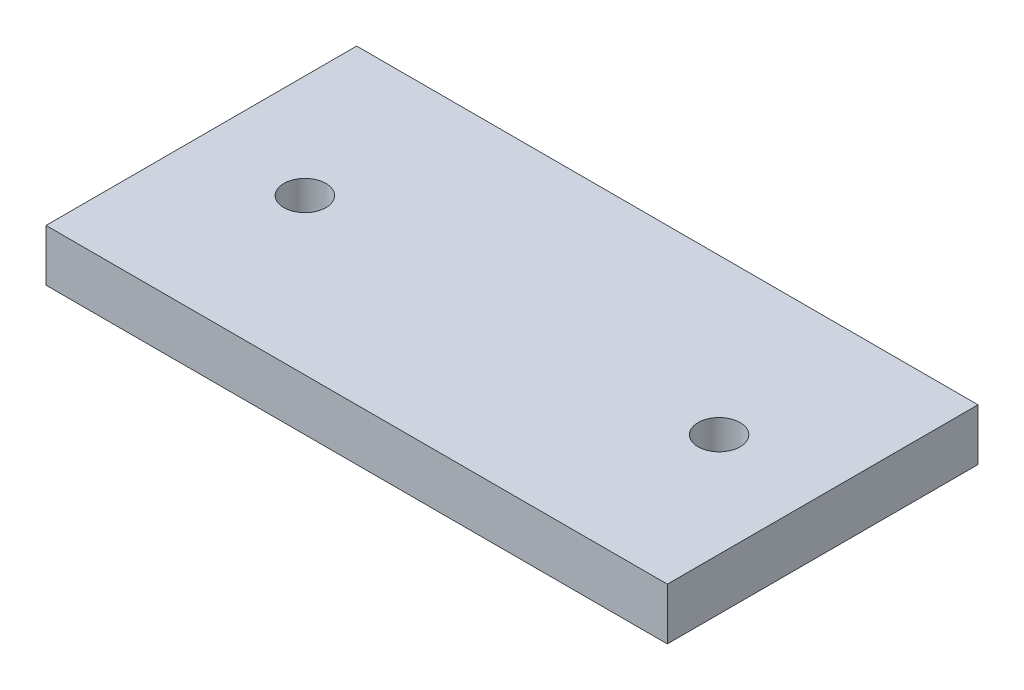
ISO-10303-21;
HEADER;
FILE_DESCRIPTION(('STEP AP214'),'2;1');
FILE_NAME('part.step','',(''),(''),'','','');
FILE_SCHEMA(('AUTOMOTIVE_DESIGN { 1 0 10303 214 1 1 1 1 }'));
ENDSEC;
DATA;
#1=APPLICATION_CONTEXT('core data for automotive mechanical design processes');
#2=APPLICATION_PROTOCOL_DEFINITION('international standard','automotive_design',2000,#1);
#3=PRODUCT_CONTEXT('',#1,'mechanical');
#4=PRODUCT('Part','Part','',(#3));
#5=PRODUCT_RELATED_PRODUCT_CATEGORY('part','',(#4));
#6=PRODUCT_DEFINITION_FORMATION('','',#4);
#7=PRODUCT_DEFINITION_CONTEXT('part definition',#1,'design');
#8=PRODUCT_DEFINITION('design','',#6,#7);
#9=PRODUCT_DEFINITION_SHAPE('','',#8);
#10=(LENGTH_UNIT() NAMED_UNIT(*) SI_UNIT(.MILLI.,.METRE.));
#11=(NAMED_UNIT(*) PLANE_ANGLE_UNIT() SI_UNIT($,.RADIAN.));
#12=(NAMED_UNIT(*) SI_UNIT($,.STERADIAN.) SOLID_ANGLE_UNIT());
#13=UNCERTAINTY_MEASURE_WITH_UNIT(LENGTH_MEASURE(1.E-05),#10,'distance_accuracy_value','');
#14=(GEOMETRIC_REPRESENTATION_CONTEXT(3) GLOBAL_UNCERTAINTY_ASSIGNED_CONTEXT((#13)) GLOBAL_UNIT_ASSIGNED_CONTEXT((#10,
#11,#12)) REPRESENTATION_CONTEXT('',''));
#15=CARTESIAN_POINT('',(0.,0.,0.));
#16=DIRECTION('',(0.,0.,1.));
#17=DIRECTION('',(1.,0.,0.));
#18=AXIS2_PLACEMENT_3D('',#15,#16,#17);
#19=CARTESIAN_POINT('',(0.,25.4,-152.4));
#20=DIRECTION('',(0.,-1.,0.));
#21=DIRECTION('',(0.,0.,-1.));
#22=AXIS2_PLACEMENT_3D('',#19,#20,#21);
#23=PLANE('',#22);
#24=CARTESIAN_POINT('',(50.8,25.4,-76.2));
#25=DIRECTION('',(0.,1.,0.));
#26=DIRECTION('',(0.,0.,1.));
#27=AXIS2_PLACEMENT_3D('',#24,#25,#26);
#28=CIRCLE('',#27,10.31875);
#29=CARTESIAN_POINT('',(50.8,25.4,-65.88125));
#30=VERTEX_POINT('',#29);
#31=EDGE_CURVE('E84',#30,#30,#28,.T.);
#32=ORIENTED_EDGE('',*,*,#31,.F.);
#33=EDGE_LOOP('',(#32));
#34=FACE_BOUND('',#33,.T.);
#35=DIRECTION('',(0.,0.,1.));
#36=VECTOR('',#35,1.);
#37=CARTESIAN_POINT('',(0.,25.4,0.));
#38=LINE('',#37,#36);
#39=CARTESIAN_POINT('',(0.,25.4,-152.4));
#40=VERTEX_POINT('',#39);
#41=CARTESIAN_POINT('',(0.,25.4,0.));
#42=VERTEX_POINT('',#41);
#43=EDGE_CURVE('E69',#40,#42,#38,.T.);
#44=ORIENTED_EDGE('',*,*,#43,.T.);
#45=DIRECTION('',(1.,0.,0.));
#46=VECTOR('',#45,1.);
#47=CARTESIAN_POINT('',(0.,25.4,0.));
#48=LINE('',#47,#46);
#49=CARTESIAN_POINT('',(304.8,25.4,0.));
#50=VERTEX_POINT('',#49);
#51=EDGE_CURVE('E64',#42,#50,#48,.T.);
#52=ORIENTED_EDGE('',*,*,#51,.T.);
#53=DIRECTION('',(0.,0.,-1.));
#54=VECTOR('',#53,1.);
#55=CARTESIAN_POINT('',(304.8,25.4,0.));
#56=LINE('',#55,#54);
#57=CARTESIAN_POINT('',(304.8,25.4,-152.4));
#58=VERTEX_POINT('',#57);
#59=EDGE_CURVE('E67',#50,#58,#56,.T.);
#60=ORIENTED_EDGE('',*,*,#59,.T.);
#61=DIRECTION('',(-1.,0.,0.));
#62=VECTOR('',#61,1.);
#63=CARTESIAN_POINT('',(0.,25.4,-152.4));
#64=LINE('',#63,#62);
#65=EDGE_CURVE('E34',#58,#40,#64,.T.);
#66=ORIENTED_EDGE('',*,*,#65,.T.);
#67=EDGE_LOOP('',(#44,#52,#60,#66));
#68=FACE_BOUND('',#67,.T.);
#69=CARTESIAN_POINT('',(254.,25.4,-76.2));
#70=DIRECTION('',(0.,1.,0.));
#71=DIRECTION('',(0.,0.,1.));
#72=AXIS2_PLACEMENT_3D('',#69,#70,#71);
#73=CIRCLE('',#72,10.31875);
#74=CARTESIAN_POINT('',(254.,25.4,-65.88125));
#75=VERTEX_POINT('',#74);
#76=EDGE_CURVE('E99',#75,#75,#73,.T.);
#77=ORIENTED_EDGE('',*,*,#76,.F.);
#78=EDGE_LOOP('',(#77));
#79=FACE_BOUND('',#78,.T.);
#80=ADVANCED_FACE('F17',(#34,#68,#79),#23,.F.);
#81=CARTESIAN_POINT('',(0.,0.,-152.4));
#82=DIRECTION('',(0.,-1.,0.));
#83=DIRECTION('',(0.,0.,-1.));
#84=AXIS2_PLACEMENT_3D('',#81,#82,#83);
#85=PLANE('',#84);
#86=CARTESIAN_POINT('',(50.8,0.,-76.2));
#87=DIRECTION('',(0.,1.,0.));
#88=DIRECTION('',(0.,0.,1.));
#89=AXIS2_PLACEMENT_3D('',#86,#87,#88);
#90=CIRCLE('',#89,10.31875);
#91=CARTESIAN_POINT('',(50.8,0.,-65.88125));
#92=VERTEX_POINT('',#91);
#93=EDGE_CURVE('E96',#92,#92,#90,.T.);
#94=ORIENTED_EDGE('',*,*,#93,.T.);
#95=EDGE_LOOP('',(#94));
#96=FACE_BOUND('',#95,.T.);
#97=DIRECTION('',(0.,0.,1.));
#98=VECTOR('',#97,1.);
#99=CARTESIAN_POINT('',(0.,0.,0.));
#100=LINE('',#99,#98);
#101=CARTESIAN_POINT('',(0.,0.,-152.4));
#102=VERTEX_POINT('',#101);
#103=CARTESIAN_POINT('',(0.,0.,0.));
#104=VERTEX_POINT('',#103);
#105=EDGE_CURVE('E81',#102,#104,#100,.T.);
#106=ORIENTED_EDGE('',*,*,#105,.F.);
#107=DIRECTION('',(-1.,0.,0.));
#108=VECTOR('',#107,1.);
#109=CARTESIAN_POINT('',(0.,0.,-152.4));
#110=LINE('',#109,#108);
#111=CARTESIAN_POINT('',(304.8,0.,-152.4));
#112=VERTEX_POINT('',#111);
#113=EDGE_CURVE('E57',#112,#102,#110,.T.);
#114=ORIENTED_EDGE('',*,*,#113,.F.);
#115=DIRECTION('',(0.,0.,-1.));
#116=VECTOR('',#115,1.);
#117=CARTESIAN_POINT('',(304.8,0.,0.));
#118=LINE('',#117,#116);
#119=CARTESIAN_POINT('',(304.8,0.,0.));
#120=VERTEX_POINT('',#119);
#121=EDGE_CURVE('E51',#120,#112,#118,.T.);
#122=ORIENTED_EDGE('',*,*,#121,.F.);
#123=DIRECTION('',(1.,0.,0.));
#124=VECTOR('',#123,1.);
#125=CARTESIAN_POINT('',(0.,0.,0.));
#126=LINE('',#125,#124);
#127=EDGE_CURVE('E73',#104,#120,#126,.T.);
#128=ORIENTED_EDGE('',*,*,#127,.F.);
#129=EDGE_LOOP('',(#106,#114,#122,#128));
#130=FACE_BOUND('',#129,.T.);
#131=CARTESIAN_POINT('',(254.,0.,-76.2));
#132=DIRECTION('',(0.,1.,0.));
#133=DIRECTION('',(0.,0.,1.));
#134=AXIS2_PLACEMENT_3D('',#131,#132,#133);
#135=CIRCLE('',#134,10.31875);
#136=CARTESIAN_POINT('',(254.,0.,-65.88125));
#137=VERTEX_POINT('',#136);
#138=EDGE_CURVE('E102',#137,#137,#135,.T.);
#139=ORIENTED_EDGE('',*,*,#138,.T.);
#140=EDGE_LOOP('',(#139));
#141=FACE_BOUND('',#140,.T.);
#142=ADVANCED_FACE('F92',(#96,#130,#141),#85,.T.);
#143=CARTESIAN_POINT('',(0.,25.4,0.));
#144=DIRECTION('',(1.,0.,0.));
#145=DIRECTION('',(0.,0.,-1.));
#146=AXIS2_PLACEMENT_3D('',#143,#144,#145);
#147=PLANE('',#146);
#148=ORIENTED_EDGE('',*,*,#105,.T.);
#149=DIRECTION('',(0.,-1.,0.));
#150=VECTOR('',#149,1.);
#151=CARTESIAN_POINT('',(0.,25.4,0.));
#152=LINE('',#151,#150);
#153=EDGE_CURVE('E11',#42,#104,#152,.T.);
#154=ORIENTED_EDGE('',*,*,#153,.F.);
#155=ORIENTED_EDGE('',*,*,#43,.F.);
#156=DIRECTION('',(0.,-1.,0.));
#157=VECTOR('',#156,1.);
#158=CARTESIAN_POINT('',(0.,25.4,-152.4));
#159=LINE('',#158,#157);
#160=EDGE_CURVE('E77',#40,#102,#159,.T.);
#161=ORIENTED_EDGE('',*,*,#160,.T.);
#162=EDGE_LOOP('',(#148,#154,#155,#161));
#163=FACE_BOUND('',#162,.T.);
#164=ADVANCED_FACE('F19',(#163),#147,.F.);
#165=CARTESIAN_POINT('',(0.,25.4,0.));
#166=DIRECTION('',(0.,0.,-1.));
#167=DIRECTION('',(-1.,0.,0.));
#168=AXIS2_PLACEMENT_3D('',#165,#166,#167);
#169=PLANE('',#168);
#170=ORIENTED_EDGE('',*,*,#127,.T.);
#171=DIRECTION('',(0.,-1.,0.));
#172=VECTOR('',#171,1.);
#173=CARTESIAN_POINT('',(304.8,25.4,0.));
#174=LINE('',#173,#172);
#175=EDGE_CURVE('E26',#50,#120,#174,.T.);
#176=ORIENTED_EDGE('',*,*,#175,.F.);
#177=ORIENTED_EDGE('',*,*,#51,.F.);
#178=ORIENTED_EDGE('',*,*,#153,.T.);
#179=EDGE_LOOP('',(#170,#176,#177,#178));
#180=FACE_BOUND('',#179,.T.);
#181=ADVANCED_FACE('F72',(#180),#169,.F.);
#182=CARTESIAN_POINT('',(304.8,25.4,0.));
#183=DIRECTION('',(-1.,0.,0.));
#184=DIRECTION('',(0.,0.,1.));
#185=AXIS2_PLACEMENT_3D('',#182,#183,#184);
#186=PLANE('',#185);
#187=ORIENTED_EDGE('',*,*,#121,.T.);
#188=DIRECTION('',(0.,-1.,0.));
#189=VECTOR('',#188,1.);
#190=CARTESIAN_POINT('',(304.8,25.4,-152.4));
#191=LINE('',#190,#189);
#192=EDGE_CURVE('E74',#58,#112,#191,.T.);
#193=ORIENTED_EDGE('',*,*,#192,.F.);
#194=ORIENTED_EDGE('',*,*,#59,.F.);
#195=ORIENTED_EDGE('',*,*,#175,.T.);
#196=EDGE_LOOP('',(#187,#193,#194,#195));
#197=FACE_BOUND('',#196,.T.);
#198=ADVANCED_FACE('F75',(#197),#186,.F.);
#199=CARTESIAN_POINT('',(0.,25.4,-152.4));
#200=DIRECTION('',(0.,0.,1.));
#201=DIRECTION('',(1.,0.,0.));
#202=AXIS2_PLACEMENT_3D('',#199,#200,#201);
#203=PLANE('',#202);
#204=ORIENTED_EDGE('',*,*,#113,.T.);
#205=ORIENTED_EDGE('',*,*,#160,.F.);
#206=ORIENTED_EDGE('',*,*,#65,.F.);
#207=ORIENTED_EDGE('',*,*,#192,.T.);
#208=EDGE_LOOP('',(#204,#205,#206,#207));
#209=FACE_BOUND('',#208,.T.);
#210=ADVANCED_FACE('F89',(#209),#203,.F.);
#211=CARTESIAN_POINT('',(50.8,25.4,-76.2));
#212=DIRECTION('',(0.,-1.,0.));
#213=DIRECTION('',(0.,0.,-1.));
#214=AXIS2_PLACEMENT_3D('',#211,#212,#213);
#215=CYLINDRICAL_SURFACE('',#214,10.31875);
#216=ORIENTED_EDGE('',*,*,#31,.T.);
#217=EDGE_LOOP('',(#216));
#218=FACE_BOUND('',#217,.T.);
#219=ORIENTED_EDGE('',*,*,#93,.F.);
#220=EDGE_LOOP('',(#219));
#221=FACE_BOUND('',#220,.T.);
#222=ADVANCED_FACE('F122',(#218,#221),#215,.F.);
#223=CARTESIAN_POINT('',(254.,25.4,-76.2));
#224=DIRECTION('',(0.,-1.,0.));
#225=DIRECTION('',(0.,0.,-1.));
#226=AXIS2_PLACEMENT_3D('',#223,#224,#225);
#227=CYLINDRICAL_SURFACE('',#226,10.31875);
#228=ORIENTED_EDGE('',*,*,#76,.T.);
#229=EDGE_LOOP('',(#228));
#230=FACE_BOUND('',#229,.T.);
#231=ORIENTED_EDGE('',*,*,#138,.F.);
#232=EDGE_LOOP('',(#231));
#233=FACE_BOUND('',#232,.T.);
#234=ADVANCED_FACE('F108',(#230,#233),#227,.F.);
#235=CLOSED_SHELL('',(#80,#142,#164,#181,#198,#210,#222,#234));
#236=MANIFOLD_SOLID_BREP('B1',#235);
#237=ADVANCED_BREP_SHAPE_REPRESENTATION('',(#18,#236),#14);
#238=SHAPE_DEFINITION_REPRESENTATION(#9,#237);
ENDSEC;
END-ISO-10303-21;
